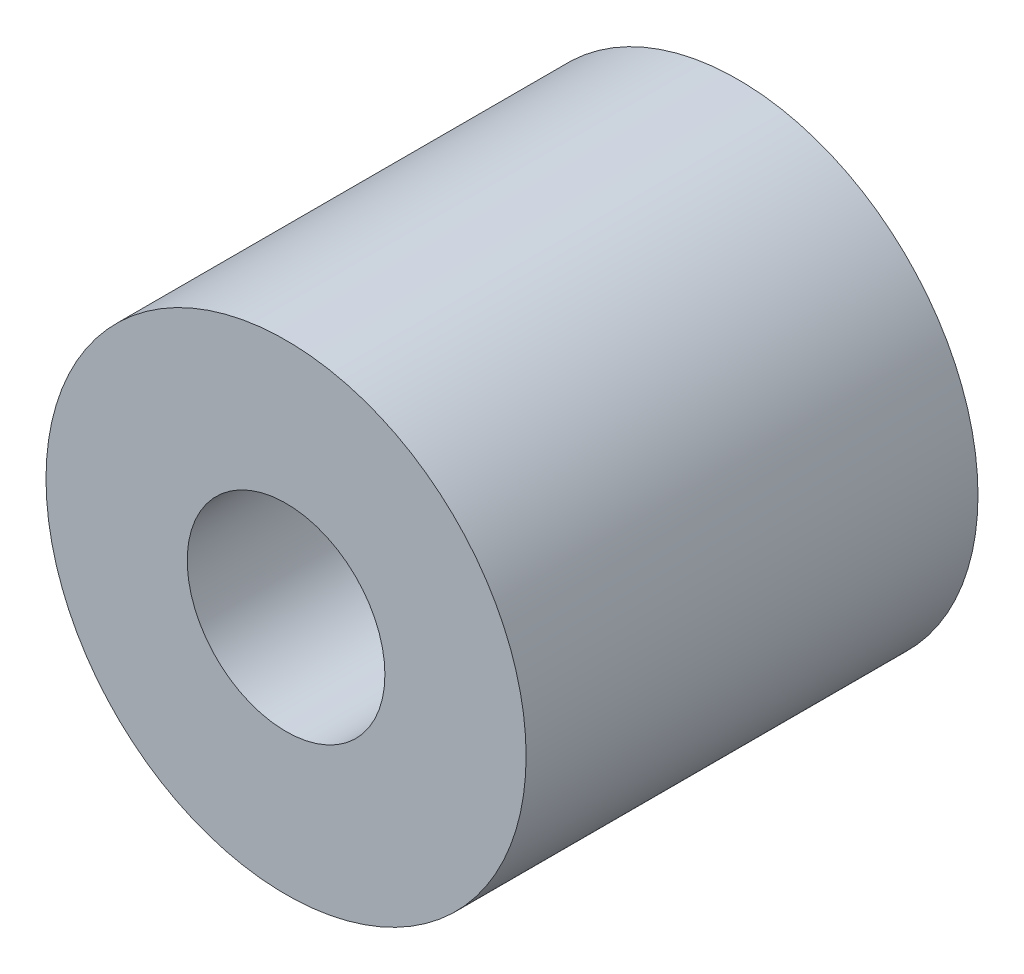
ISO-10303-21;
HEADER;
FILE_DESCRIPTION(('STEP AP214'),'2;1');
FILE_NAME('part.step','',(''),(''),'','','');
FILE_SCHEMA(('AUTOMOTIVE_DESIGN { 1 0 10303 214 1 1 1 1 }'));
ENDSEC;
DATA;
#1=APPLICATION_CONTEXT('core data for automotive mechanical design processes');
#2=APPLICATION_PROTOCOL_DEFINITION('international standard','automotive_design',2000,#1);
#3=PRODUCT_CONTEXT('',#1,'mechanical');
#4=PRODUCT('Part','Part','',(#3));
#5=PRODUCT_RELATED_PRODUCT_CATEGORY('part','',(#4));
#6=PRODUCT_DEFINITION_FORMATION('','',#4);
#7=PRODUCT_DEFINITION_CONTEXT('part definition',#1,'design');
#8=PRODUCT_DEFINITION('design','',#6,#7);
#9=PRODUCT_DEFINITION_SHAPE('','',#8);
#10=(LENGTH_UNIT() NAMED_UNIT(*) SI_UNIT(.MILLI.,.METRE.));
#11=(NAMED_UNIT(*) PLANE_ANGLE_UNIT() SI_UNIT($,.RADIAN.));
#12=(NAMED_UNIT(*) SI_UNIT($,.STERADIAN.) SOLID_ANGLE_UNIT());
#13=UNCERTAINTY_MEASURE_WITH_UNIT(LENGTH_MEASURE(1.E-05),#10,'distance_accuracy_value','');
#14=(GEOMETRIC_REPRESENTATION_CONTEXT(3) GLOBAL_UNCERTAINTY_ASSIGNED_CONTEXT((#13)) GLOBAL_UNIT_ASSIGNED_CONTEXT((#10,
#11,#12)) REPRESENTATION_CONTEXT('',''));
#15=CARTESIAN_POINT('',(0.,0.,0.));
#16=DIRECTION('',(0.,0.,1.));
#17=DIRECTION('',(1.,0.,0.));
#18=AXIS2_PLACEMENT_3D('',#15,#16,#17);
#19=CARTESIAN_POINT('',(0.,0.,16.));
#20=DIRECTION('',(0.,0.,1.));
#21=DIRECTION('',(1.,0.,0.));
#22=AXIS2_PLACEMENT_3D('',#19,#20,#21);
#23=PLANE('',#22);
#24=CARTESIAN_POINT('',(0.,0.,16.));
#25=DIRECTION('',(0.,0.,1.));
#26=DIRECTION('',(1.,0.,0.));
#27=AXIS2_PLACEMENT_3D('',#24,#25,#26);
#28=CIRCLE('',#27,8.5);
#29=CARTESIAN_POINT('',(8.5,0.,16.));
#30=VERTEX_POINT('',#29);
#31=EDGE_CURVE('E10',#30,#30,#28,.T.);
#32=ORIENTED_EDGE('',*,*,#31,.T.);
#33=EDGE_LOOP('',(#32));
#34=FACE_BOUND('',#33,.T.);
#35=CARTESIAN_POINT('',(0.,0.,16.));
#36=DIRECTION('',(0.,0.,1.));
#37=DIRECTION('',(1.,0.,0.));
#38=AXIS2_PLACEMENT_3D('',#35,#36,#37);
#39=CIRCLE('',#38,3.5);
#40=CARTESIAN_POINT('',(3.5,0.,16.));
#41=VERTEX_POINT('',#40);
#42=EDGE_CURVE('E42',#41,#41,#39,.T.);
#43=ORIENTED_EDGE('',*,*,#42,.F.);
#44=EDGE_LOOP('',(#43));
#45=FACE_BOUND('',#44,.T.);
#46=ADVANCED_FACE('F31',(#34,#45),#23,.T.);
#47=CARTESIAN_POINT('',(0.,0.,0.));
#48=DIRECTION('',(0.,0.,1.));
#49=DIRECTION('',(1.,0.,0.));
#50=AXIS2_PLACEMENT_3D('',#47,#48,#49);
#51=PLANE('',#50);
#52=CARTESIAN_POINT('',(0.,0.,0.));
#53=DIRECTION('',(0.,0.,1.));
#54=DIRECTION('',(1.,0.,0.));
#55=AXIS2_PLACEMENT_3D('',#52,#53,#54);
#56=CIRCLE('',#55,8.5);
#57=CARTESIAN_POINT('',(8.5,0.,0.));
#58=VERTEX_POINT('',#57);
#59=EDGE_CURVE('E35',#58,#58,#56,.T.);
#60=ORIENTED_EDGE('',*,*,#59,.F.);
#61=EDGE_LOOP('',(#60));
#62=FACE_BOUND('',#61,.T.);
#63=CARTESIAN_POINT('',(0.,0.,0.));
#64=DIRECTION('',(0.,0.,1.));
#65=DIRECTION('',(1.,0.,0.));
#66=AXIS2_PLACEMENT_3D('',#63,#64,#65);
#67=CIRCLE('',#66,3.5);
#68=CARTESIAN_POINT('',(3.5,0.,0.));
#69=VERTEX_POINT('',#68);
#70=EDGE_CURVE('E44',#69,#69,#67,.T.);
#71=ORIENTED_EDGE('',*,*,#70,.T.);
#72=EDGE_LOOP('',(#71));
#73=FACE_BOUND('',#72,.T.);
#74=ADVANCED_FACE('F54',(#62,#73),#51,.F.);
#75=CARTESIAN_POINT('',(0.,0.,16.));
#76=DIRECTION('',(0.,0.,-1.));
#77=DIRECTION('',(-1.,0.,0.));
#78=AXIS2_PLACEMENT_3D('',#75,#76,#77);
#79=CYLINDRICAL_SURFACE('',#78,8.5);
#80=ORIENTED_EDGE('',*,*,#31,.F.);
#81=EDGE_LOOP('',(#80));
#82=FACE_BOUND('',#81,.T.);
#83=ORIENTED_EDGE('',*,*,#59,.T.);
#84=EDGE_LOOP('',(#83));
#85=FACE_BOUND('',#84,.T.);
#86=ADVANCED_FACE('F33',(#82,#85),#79,.T.);
#87=CARTESIAN_POINT('',(0.,0.,16.));
#88=DIRECTION('',(0.,0.,-1.));
#89=DIRECTION('',(-1.,0.,0.));
#90=AXIS2_PLACEMENT_3D('',#87,#88,#89);
#91=CYLINDRICAL_SURFACE('',#90,3.5);
#92=ORIENTED_EDGE('',*,*,#42,.T.);
#93=EDGE_LOOP('',(#92));
#94=FACE_BOUND('',#93,.T.);
#95=ORIENTED_EDGE('',*,*,#70,.F.);
#96=EDGE_LOOP('',(#95));
#97=FACE_BOUND('',#96,.T.);
#98=ADVANCED_FACE('F50',(#94,#97),#91,.F.);
#99=CLOSED_SHELL('',(#46,#74,#86,#98));
#100=MANIFOLD_SOLID_BREP('B2',#99);
#101=ADVANCED_BREP_SHAPE_REPRESENTATION('',(#18,#100),#14);
#102=SHAPE_DEFINITION_REPRESENTATION(#9,#101);
ENDSEC;
END-ISO-10303-21;
